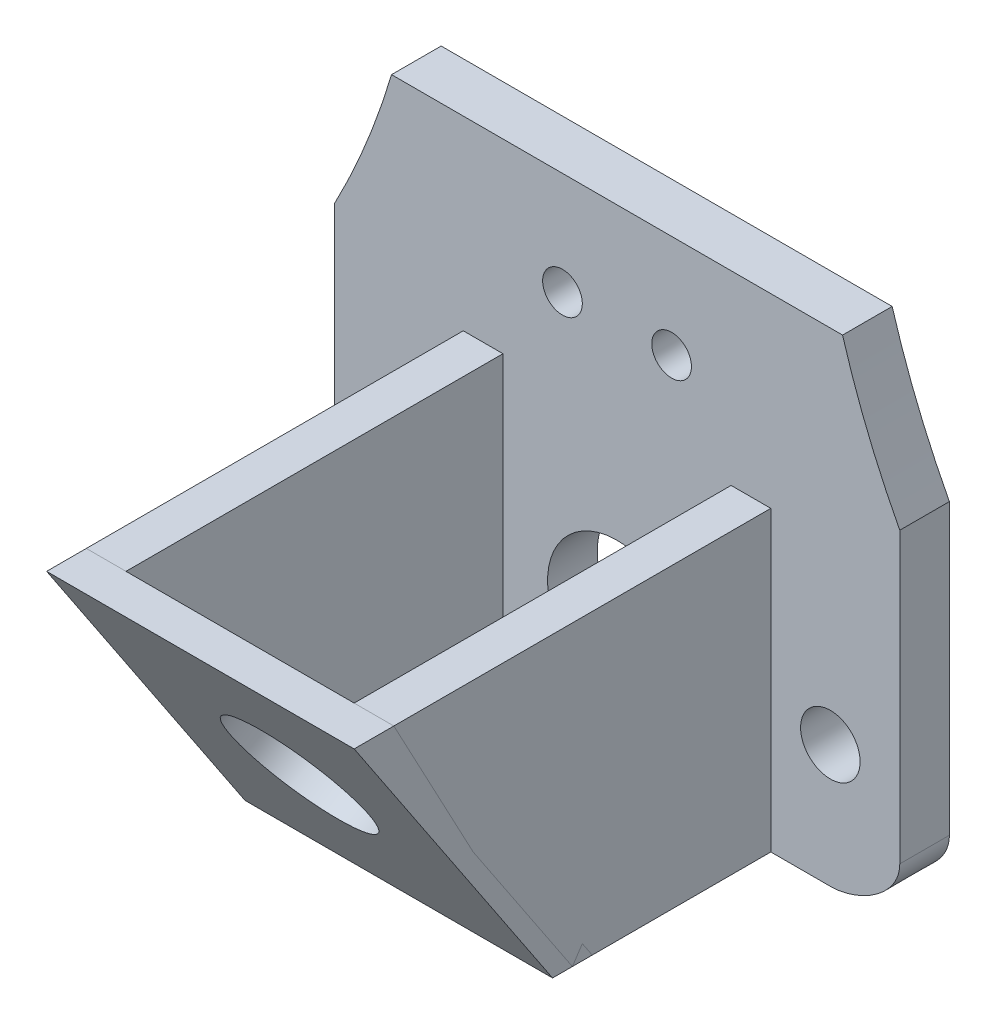
ISO-10303-21;
HEADER;
FILE_DESCRIPTION(('STEP AP214'),'2;1');
FILE_NAME('part.step','',(''),(''),'','','');
FILE_SCHEMA(('AUTOMOTIVE_DESIGN { 1 0 10303 214 1 1 1 1 }'));
ENDSEC;
DATA;
#1=APPLICATION_CONTEXT('core data for automotive mechanical design processes');
#2=APPLICATION_PROTOCOL_DEFINITION('international standard','automotive_design',2000,#1);
#3=PRODUCT_CONTEXT('',#1,'mechanical');
#4=PRODUCT('Part','Part','',(#3));
#5=PRODUCT_RELATED_PRODUCT_CATEGORY('part','',(#4));
#6=PRODUCT_DEFINITION_FORMATION('','',#4);
#7=PRODUCT_DEFINITION_CONTEXT('part definition',#1,'design');
#8=PRODUCT_DEFINITION('design','',#6,#7);
#9=PRODUCT_DEFINITION_SHAPE('','',#8);
#10=(LENGTH_UNIT() NAMED_UNIT(*) SI_UNIT(.MILLI.,.METRE.));
#11=(NAMED_UNIT(*) PLANE_ANGLE_UNIT() SI_UNIT($,.RADIAN.));
#12=(NAMED_UNIT(*) SI_UNIT($,.STERADIAN.) SOLID_ANGLE_UNIT());
#13=UNCERTAINTY_MEASURE_WITH_UNIT(LENGTH_MEASURE(1.E-05),#10,'distance_accuracy_value','');
#14=(GEOMETRIC_REPRESENTATION_CONTEXT(3) GLOBAL_UNCERTAINTY_ASSIGNED_CONTEXT((#13)) GLOBAL_UNIT_ASSIGNED_CONTEXT((#10,
#11,#12)) REPRESENTATION_CONTEXT('',''));
#15=CARTESIAN_POINT('',(0.,0.,0.));
#16=DIRECTION('',(0.,0.,1.));
#17=DIRECTION('',(1.,0.,0.));
#18=AXIS2_PLACEMENT_3D('',#15,#16,#17);
#19=CARTESIAN_POINT('',(17.4365114727916,15.948106541219,13.5));
#20=DIRECTION('',(1.,0.,0.));
#21=DIRECTION('',(0.,0.,-1.));
#22=AXIS2_PLACEMENT_3D('',#19,#20,#21);
#23=PLANE('',#22);
#24=DIRECTION('',(0.,0.,-1.));
#25=VECTOR('',#24,1.);
#26=CARTESIAN_POINT('',(17.4365114727916,30.948106541219,23.5));
#27=LINE('',#26,#25);
#28=CARTESIAN_POINT('',(17.4365114727916,30.948106541219,23.5));
#29=VERTEX_POINT('',#28);
#30=CARTESIAN_POINT('',(17.4365114727916,30.948106541219,21.5));
#31=VERTEX_POINT('',#30);
#32=EDGE_CURVE('E382',#29,#31,#27,.T.);
#33=ORIENTED_EDGE('',*,*,#32,.T.);
#34=DIRECTION('',(0.,-0.832050294337844,-0.554700196225229));
#35=VECTOR('',#34,1.);
#36=CARTESIAN_POINT('',(17.4365114727916,15.948106541219,11.5));
#37=LINE('',#36,#35);
#38=CARTESIAN_POINT('',(17.4365114727916,15.948106541219,11.5));
#39=VERTEX_POINT('',#38);
#40=EDGE_CURVE('E377',#31,#39,#37,.T.);
#41=ORIENTED_EDGE('',*,*,#40,.T.);
#42=DIRECTION('',(0.,0.,-1.));
#43=VECTOR('',#42,1.);
#44=CARTESIAN_POINT('',(17.4365114727916,15.948106541219,13.5));
#45=LINE('',#44,#43);
#46=CARTESIAN_POINT('',(17.4365114727916,15.948106541219,13.5));
#47=VERTEX_POINT('',#46);
#48=EDGE_CURVE('E14',#47,#39,#45,.T.);
#49=ORIENTED_EDGE('',*,*,#48,.F.);
#50=DIRECTION('',(0.,-0.832050294337844,-0.554700196225229));
#51=VECTOR('',#50,1.);
#52=CARTESIAN_POINT('',(17.4365114727916,15.948106541219,13.5));
#53=LINE('',#52,#51);
#54=EDGE_CURVE('E391',#29,#47,#53,.T.);
#55=ORIENTED_EDGE('',*,*,#54,.F.);
#56=EDGE_LOOP('',(#33,#41,#49,#55));
#57=FACE_BOUND('',#56,.T.);
#58=ADVANCED_FACE('F324',(#57),#23,.F.);
#59=CARTESIAN_POINT('',(32.9365114727916,15.948106541219,13.5));
#60=DIRECTION('',(0.,1.,0.));
#61=DIRECTION('',(-1.,0.,0.));
#62=AXIS2_PLACEMENT_3D('',#59,#60,#61);
#63=PLANE('',#62);
#64=ORIENTED_EDGE('',*,*,#48,.T.);
#65=DIRECTION('',(1.,0.,0.));
#66=VECTOR('',#65,1.);
#67=CARTESIAN_POINT('',(32.9365114727916,15.948106541219,11.5));
#68=LINE('',#67,#66);
#69=CARTESIAN_POINT('',(32.9365114727916,15.948106541219,11.5));
#70=VERTEX_POINT('',#69);
#71=EDGE_CURVE('E367',#39,#70,#68,.T.);
#72=ORIENTED_EDGE('',*,*,#71,.T.);
#73=DIRECTION('',(0.,0.,-1.));
#74=VECTOR('',#73,1.);
#75=CARTESIAN_POINT('',(32.9365114727916,15.948106541219,13.5));
#76=LINE('',#75,#74);
#77=CARTESIAN_POINT('',(32.9365114727916,15.948106541219,13.5));
#78=VERTEX_POINT('',#77);
#79=EDGE_CURVE('E332',#78,#70,#76,.T.);
#80=ORIENTED_EDGE('',*,*,#79,.F.);
#81=DIRECTION('',(1.,0.,0.));
#82=VECTOR('',#81,1.);
#83=CARTESIAN_POINT('',(32.9365114727916,15.948106541219,13.5));
#84=LINE('',#83,#82);
#85=EDGE_CURVE('E368',#47,#78,#84,.T.);
#86=ORIENTED_EDGE('',*,*,#85,.F.);
#87=EDGE_LOOP('',(#64,#72,#80,#86));
#88=FACE_BOUND('',#87,.T.);
#89=ADVANCED_FACE('F365',(#88),#63,.F.);
#90=CARTESIAN_POINT('',(32.9365114727916,30.948106541219,23.5));
#91=DIRECTION('',(-1.,0.,0.));
#92=DIRECTION('',(0.,0.,1.));
#93=AXIS2_PLACEMENT_3D('',#90,#91,#92);
#94=PLANE('',#93);
#95=ORIENTED_EDGE('',*,*,#79,.T.);
#96=DIRECTION('',(0.,0.832050294337844,0.554700196225229));
#97=VECTOR('',#96,1.);
#98=CARTESIAN_POINT('',(32.9365114727916,30.948106541219,21.5));
#99=LINE('',#98,#97);
#100=CARTESIAN_POINT('',(32.9365114727916,30.948106541219,21.5));
#101=VERTEX_POINT('',#100);
#102=EDGE_CURVE('E380',#70,#101,#99,.T.);
#103=ORIENTED_EDGE('',*,*,#102,.T.);
#104=DIRECTION('',(0.,0.,-1.));
#105=VECTOR('',#104,1.);
#106=CARTESIAN_POINT('',(32.9365114727916,30.948106541219,23.5));
#107=LINE('',#106,#105);
#108=CARTESIAN_POINT('',(32.9365114727916,30.948106541219,23.5));
#109=VERTEX_POINT('',#108);
#110=EDGE_CURVE('E397',#109,#101,#107,.T.);
#111=ORIENTED_EDGE('',*,*,#110,.F.);
#112=DIRECTION('',(0.,0.832050294337844,0.554700196225229));
#113=VECTOR('',#112,1.);
#114=CARTESIAN_POINT('',(32.9365114727916,30.948106541219,23.5));
#115=LINE('',#114,#113);
#116=EDGE_CURVE('E344',#78,#109,#115,.T.);
#117=ORIENTED_EDGE('',*,*,#116,.F.);
#118=EDGE_LOOP('',(#95,#103,#111,#117));
#119=FACE_BOUND('',#118,.T.);
#120=ADVANCED_FACE('F400',(#119),#94,.F.);
#121=CARTESIAN_POINT('',(17.4365114727916,30.948106541219,23.5));
#122=DIRECTION('',(0.,-1.,0.));
#123=DIRECTION('',(1.,0.,0.));
#124=AXIS2_PLACEMENT_3D('',#121,#122,#123);
#125=PLANE('',#124);
#126=ORIENTED_EDGE('',*,*,#110,.T.);
#127=DIRECTION('',(-1.,0.,0.));
#128=VECTOR('',#127,1.);
#129=CARTESIAN_POINT('',(17.4365114727916,30.948106541219,21.5));
#130=LINE('',#129,#128);
#131=EDGE_CURVE('E389',#101,#31,#130,.T.);
#132=ORIENTED_EDGE('',*,*,#131,.T.);
#133=ORIENTED_EDGE('',*,*,#32,.F.);
#134=DIRECTION('',(-1.,0.,0.));
#135=VECTOR('',#134,1.);
#136=CARTESIAN_POINT('',(17.4365114727916,30.948106541219,23.5));
#137=LINE('',#136,#135);
#138=EDGE_CURVE('E339',#109,#29,#137,.T.);
#139=ORIENTED_EDGE('',*,*,#138,.F.);
#140=EDGE_LOOP('',(#126,#132,#133,#139));
#141=FACE_BOUND('',#140,.T.);
#142=ADVANCED_FACE('F402',(#141),#125,.F.);
#143=CARTESIAN_POINT('',(0.,-0.86212106424031,2.29318159636046));
#144=DIRECTION('',(0.,0.554700196225229,-0.832050294337844));
#145=DIRECTION('',(0.,0.832050294337844,0.554700196225229));
#146=AXIS2_PLACEMENT_3D('',#143,#144,#145);
#147=PLANE('',#146);
#148=CARTESIAN_POINT('',(25.1865114727916,23.448106541219,18.5));
#149=DIRECTION('',(0.,-0.554700196225229,0.832050294337843));
#150=DIRECTION('',(0.,-0.832050294337843,-0.554700196225229));
#151=AXIS2_PLACEMENT_3D('',#148,#149,#150);
#152=CIRCLE('',#151,3.5);
#153=CARTESIAN_POINT('',(25.1865114727916,20.5359305110365,16.5585493132117));
#154=VERTEX_POINT('',#153);
#155=EDGE_CURVE('E385',#154,#154,#152,.T.);
#156=ORIENTED_EDGE('',*,*,#155,.F.);
#157=EDGE_LOOP('',(#156));
#158=FACE_BOUND('',#157,.T.);
#159=ORIENTED_EDGE('',*,*,#54,.T.);
#160=ORIENTED_EDGE('',*,*,#85,.T.);
#161=ORIENTED_EDGE('',*,*,#116,.T.);
#162=ORIENTED_EDGE('',*,*,#138,.T.);
#163=EDGE_LOOP('',(#159,#160,#161,#162));
#164=FACE_BOUND('',#163,.T.);
#165=ADVANCED_FACE('F403',(#158,#164),#147,.F.);
#166=CARTESIAN_POINT('',(0.,-0.86212106424031,0.293181596360463));
#167=DIRECTION('',(0.,0.554700196225229,-0.832050294337844));
#168=DIRECTION('',(0.,0.832050294337844,0.554700196225229));
#169=AXIS2_PLACEMENT_3D('',#166,#167,#168);
#170=PLANE('',#169);
#171=CARTESIAN_POINT('',(25.1865114727916,24.3711834642959,17.1153846153846));
#172=DIRECTION('',(0.,0.554700196225229,-0.832050294337844));
#173=DIRECTION('',(0.,0.832050294337844,0.554700196225229));
#174=AXIS2_PLACEMENT_3D('',#171,#172,#173);
#175=CIRCLE('',#174,3.5);
#176=CARTESIAN_POINT('',(25.1865114727916,27.2833594944784,19.0568353021729));
#177=VERTEX_POINT('',#176);
#178=EDGE_CURVE('E327',#177,#177,#175,.T.);
#179=ORIENTED_EDGE('',*,*,#178,.F.);
#180=EDGE_LOOP('',(#179));
#181=FACE_BOUND('',#180,.T.);
#182=ORIENTED_EDGE('',*,*,#40,.F.);
#183=ORIENTED_EDGE('',*,*,#131,.F.);
#184=ORIENTED_EDGE('',*,*,#102,.F.);
#185=ORIENTED_EDGE('',*,*,#71,.F.);
#186=EDGE_LOOP('',(#182,#183,#184,#185));
#187=FACE_BOUND('',#186,.T.);
#188=ADVANCED_FACE('F375',(#181,#187),#170,.T.);
#189=CARTESIAN_POINT('',(25.1865114727916,24.5575069336694,16.8358994113243));
#190=DIRECTION('',(0.,-0.554700196225229,0.832050294337843));
#191=DIRECTION('',(0.,-0.832050294337843,-0.554700196225229));
#192=AXIS2_PLACEMENT_3D('',#189,#190,#191);
#193=CYLINDRICAL_SURFACE('',#192,3.5);
#194=ORIENTED_EDGE('',*,*,#178,.T.);
#195=EDGE_LOOP('',(#194));
#196=FACE_BOUND('',#195,.T.);
#197=ORIENTED_EDGE('',*,*,#155,.T.);
#198=EDGE_LOOP('',(#197));
#199=FACE_BOUND('',#198,.T.);
#200=ADVANCED_FACE('F411',(#196,#199),#193,.F.);
#201=CLOSED_SHELL('',(#58,#89,#120,#142,#165,#188,#200));
#202=MANIFOLD_SOLID_BREP('B2',#201);
#203=CARTESIAN_POINT('',(38.4875310770758,83.0702422145585,2.5));
#204=DIRECTION('',(0.,0.,1.));
#205=DIRECTION('',(1.,0.,0.));
#206=AXIS2_PLACEMENT_3D('',#203,#204,#205);
#207=PLANE('',#206);
#208=DIRECTION('',(0.999999997232007,-7.44042106525713E-05,0.));
#209=VECTOR('',#208,1.);
#210=CARTESIAN_POINT('',(38.4843502252668,40.3192772856274,2.5));
#211=LINE('',#210,#209);
#212=CARTESIAN_POINT('',(13.8211849833558,40.3211123289745,2.5));
#213=VERTEX_POINT('',#212);
#214=CARTESIAN_POINT('',(36.5523405300605,40.3194210352842,2.5));
#215=VERTEX_POINT('',#214);
#216=EDGE_CURVE('E580',#213,#215,#211,.T.);
#217=ORIENTED_EDGE('',*,*,#216,.F.);
#218=CARTESIAN_POINT('',(-23.5634885272084,51.4290458230372,2.5));
#219=DIRECTION('',(0.,0.,1.));
#220=DIRECTION('',(1.,0.,0.));
#221=AXIS2_PLACEMENT_3D('',#218,#219,#220);
#222=CIRCLE('',#221,39.);
#223=CARTESIAN_POINT('',(10.9365114727916,33.242512343564,2.5));
#224=VERTEX_POINT('',#223);
#225=EDGE_CURVE('E587',#224,#213,#222,.T.);
#226=ORIENTED_EDGE('',*,*,#225,.F.);
#227=DIRECTION('',(0.,-1.,0.));
#228=VECTOR('',#227,1.);
#229=CARTESIAN_POINT('',(10.9365114727916,22.1790458230372,2.5));
#230=LINE('',#229,#228);
#231=CARTESIAN_POINT('',(10.9365114727916,18.6790458230372,2.5));
#232=VERTEX_POINT('',#231);
#233=EDGE_CURVE('E713',#224,#232,#230,.T.);
#234=ORIENTED_EDGE('',*,*,#233,.T.);
#235=CARTESIAN_POINT('',(10.9365114727916,18.6790458230372,2.5));
#236=CARTESIAN_POINT('',(10.9365114727916,17.1992549458831,2.5));
#237=CARTESIAN_POINT('',(12.9567205956374,15.948106541219,2.5));
#238=CARTESIAN_POINT('',(14.4365114727916,15.948106541219,2.5));
#239=B_SPLINE_CURVE_WITH_KNOTS('',3,(#235,#236,#237,#238),.UNSPECIFIED.,.F.,.F.,(4,4),(0.,
4.43937263146244),.UNSPECIFIED.);
#240=CARTESIAN_POINT('',(14.4365114727916,15.948106541219,2.5));
#241=VERTEX_POINT('',#240);
#242=EDGE_CURVE('E707',#232,#241,#239,.T.);
#243=ORIENTED_EDGE('',*,*,#242,.T.);
#244=DIRECTION('',(1.,0.,0.));
#245=VECTOR('',#244,1.);
#246=CARTESIAN_POINT('',(25.1865114727916,15.948106541219,2.5));
#247=LINE('',#246,#245);
#248=CARTESIAN_POINT('',(17.4365114727916,15.948106541219,2.5));
#249=VERTEX_POINT('',#248);
#250=EDGE_CURVE('E688',#241,#249,#247,.T.);
#251=ORIENTED_EDGE('',*,*,#250,.T.);
#252=DIRECTION('',(0.,-1.,0.));
#253=VECTOR('',#252,1.);
#254=CARTESIAN_POINT('',(17.4365114727916,15.948106541219,2.5));
#255=LINE('',#254,#253);
#256=CARTESIAN_POINT('',(17.4365114727916,30.948106541219,2.5));
#257=VERTEX_POINT('',#256);
#258=EDGE_CURVE('E628',#257,#249,#255,.T.);
#259=ORIENTED_EDGE('',*,*,#258,.F.);
#260=DIRECTION('',(-1.,0.,0.));
#261=VECTOR('',#260,1.);
#262=CARTESIAN_POINT('',(17.4365114727916,30.948106541219,2.5));
#263=LINE('',#262,#261);
#264=CARTESIAN_POINT('',(19.4365114727916,30.948106541219,2.5));
#265=VERTEX_POINT('',#264);
#266=EDGE_CURVE('E642',#265,#257,#263,.T.);
#267=ORIENTED_EDGE('',*,*,#266,.F.);
#268=DIRECTION('',(0.,1.,0.));
#269=VECTOR('',#268,1.);
#270=CARTESIAN_POINT('',(19.4365114727916,30.948106541219,2.5));
#271=LINE('',#270,#269);
#272=CARTESIAN_POINT('',(19.4365114727916,17.948106541219,2.5));
#273=VERTEX_POINT('',#272);
#274=EDGE_CURVE('E640',#273,#265,#271,.T.);
#275=ORIENTED_EDGE('',*,*,#274,.F.);
#276=DIRECTION('',(-1.,0.,0.));
#277=VECTOR('',#276,1.);
#278=CARTESIAN_POINT('',(30.9365114727916,17.948106541219,2.5));
#279=LINE('',#278,#277);
#280=CARTESIAN_POINT('',(30.9365114727916,17.948106541219,2.5));
#281=VERTEX_POINT('',#280);
#282=EDGE_CURVE('E637',#281,#273,#279,.T.);
#283=ORIENTED_EDGE('',*,*,#282,.F.);
#284=DIRECTION('',(0.,-1.,0.));
#285=VECTOR('',#284,1.);
#286=CARTESIAN_POINT('',(30.9365114727916,30.948106541219,2.5));
#287=LINE('',#286,#285);
#288=CARTESIAN_POINT('',(30.9365114727916,30.948106541219,2.5));
#289=VERTEX_POINT('',#288);
#290=EDGE_CURVE('E634',#289,#281,#287,.T.);
#291=ORIENTED_EDGE('',*,*,#290,.F.);
#292=DIRECTION('',(-1.,0.,0.));
#293=VECTOR('',#292,1.);
#294=CARTESIAN_POINT('',(32.9365114727916,30.948106541219,2.5));
#295=LINE('',#294,#293);
#296=CARTESIAN_POINT('',(32.9365114727916,30.948106541219,2.5));
#297=VERTEX_POINT('',#296);
#298=EDGE_CURVE('E632',#297,#289,#295,.T.);
#299=ORIENTED_EDGE('',*,*,#298,.F.);
#300=DIRECTION('',(0.,1.,0.));
#301=VECTOR('',#300,1.);
#302=CARTESIAN_POINT('',(32.9365114727916,15.948106541219,2.5));
#303=LINE('',#302,#301);
#304=CARTESIAN_POINT('',(32.9365114727916,15.948106541219,2.5));
#305=VERTEX_POINT('',#304);
#306=EDGE_CURVE('E624',#305,#297,#303,.T.);
#307=ORIENTED_EDGE('',*,*,#306,.F.);
#308=CARTESIAN_POINT('',(35.9365114727916,15.948106541219,2.5));
#309=VERTEX_POINT('',#308);
#310=EDGE_CURVE('E687',#305,#309,#247,.T.);
#311=ORIENTED_EDGE('',*,*,#310,.T.);
#312=CARTESIAN_POINT('',(39.4365114727916,18.6790458230372,2.5));
#313=CARTESIAN_POINT('',(39.4365114727916,17.1992549458831,2.5));
#314=CARTESIAN_POINT('',(37.4163023499458,15.948106541219,2.5));
#315=CARTESIAN_POINT('',(35.9365114727916,15.948106541219,2.5));
#316=B_SPLINE_CURVE_WITH_KNOTS('',3,(#312,#313,#314,#315),.UNSPECIFIED.,.F.,.F.,(4,4),(0.,
4.43937263146244),.UNSPECIFIED.);
#317=CARTESIAN_POINT('',(39.4365114727916,18.6790458230372,2.5));
#318=VERTEX_POINT('',#317);
#319=EDGE_CURVE('E680',#318,#309,#316,.T.);
#320=ORIENTED_EDGE('',*,*,#319,.F.);
#321=DIRECTION('',(0.,-1.,0.));
#322=VECTOR('',#321,1.);
#323=CARTESIAN_POINT('',(39.4365114727916,80.6790458230372,2.5));
#324=LINE('',#323,#322);
#325=CARTESIAN_POINT('',(39.4365114727916,33.242512343564,2.5));
#326=VERTEX_POINT('',#325);
#327=EDGE_CURVE('E678',#326,#318,#324,.T.);
#328=ORIENTED_EDGE('',*,*,#327,.F.);
#329=CARTESIAN_POINT('',(73.9365114727916,51.4290458230372,2.5));
#330=DIRECTION('',(0.,0.,1.));
#331=DIRECTION('',(1.,0.,0.));
#332=AXIS2_PLACEMENT_3D('',#329,#330,#331);
#333=CIRCLE('',#332,39.);
#334=EDGE_CURVE('E590',#215,#326,#333,.T.);
#335=ORIENTED_EDGE('',*,*,#334,.F.);
#336=EDGE_LOOP('',(#217,#226,#234,#243,#251,#259,#267,#275,#283,#291,#299,#307,#311,#320,#328,#335));
#337=FACE_BOUND('',#336,.T.);
#338=CARTESIAN_POINT('',(22.4365114727916,35.1326961955504,2.5));
#339=DIRECTION('',(0.,0.,1.));
#340=DIRECTION('',(1.,0.,0.));
#341=AXIS2_PLACEMENT_3D('',#338,#339,#340);
#342=CIRCLE('',#341,1.);
#343=CARTESIAN_POINT('',(23.4365114727916,35.1326961955504,2.5));
#344=VERTEX_POINT('',#343);
#345=EDGE_CURVE('E786',#344,#344,#342,.T.);
#346=ORIENTED_EDGE('',*,*,#345,.F.);
#347=EDGE_LOOP('',(#346));
#348=FACE_BOUND('',#347,.T.);
#349=CARTESIAN_POINT('',(27.9365114727916,35.1326961955504,2.5));
#350=DIRECTION('',(0.,0.,1.));
#351=DIRECTION('',(1.,0.,0.));
#352=AXIS2_PLACEMENT_3D('',#349,#350,#351);
#353=CIRCLE('',#352,1.);
#354=CARTESIAN_POINT('',(28.9365114727916,35.1326961955504,2.5));
#355=VERTEX_POINT('',#354);
#356=EDGE_CURVE('E591',#355,#355,#353,.T.);
#357=ORIENTED_EDGE('',*,*,#356,.F.);
#358=EDGE_LOOP('',(#357));
#359=FACE_BOUND('',#358,.T.);
#360=CARTESIAN_POINT('',(25.1865114727916,22.1790458230372,2.5));
#361=DIRECTION('',(0.,0.,1.));
#362=DIRECTION('',(1.,0.,0.));
#363=AXIS2_PLACEMENT_3D('',#360,#361,#362);
#364=CIRCLE('',#363,3.5);
#365=CARTESIAN_POINT('',(28.6865114727916,22.1790458230372,2.5));
#366=VERTEX_POINT('',#365);
#367=EDGE_CURVE('E603',#366,#366,#364,.T.);
#368=ORIENTED_EDGE('',*,*,#367,.F.);
#369=EDGE_LOOP('',(#368));
#370=FACE_BOUND('',#369,.T.);
#371=CARTESIAN_POINT('',(35.9365114727916,22.1326961955504,2.5));
#372=DIRECTION('',(0.,0.,1.));
#373=DIRECTION('',(1.,0.,0.));
#374=AXIS2_PLACEMENT_3D('',#371,#372,#373);
#375=CIRCLE('',#374,1.5);
#376=CARTESIAN_POINT('',(37.4365114727916,22.1326961955504,2.5));
#377=VERTEX_POINT('',#376);
#378=EDGE_CURVE('E672',#377,#377,#375,.T.);
#379=ORIENTED_EDGE('',*,*,#378,.F.);
#380=EDGE_LOOP('',(#379));
#381=FACE_BOUND('',#380,.T.);
#382=CARTESIAN_POINT('',(14.4365114727916,22.1326961955504,2.5));
#383=DIRECTION('',(0.,0.,1.));
#384=DIRECTION('',(1.,0.,0.));
#385=AXIS2_PLACEMENT_3D('',#382,#383,#384);
#386=CIRCLE('',#385,1.5);
#387=CARTESIAN_POINT('',(15.9365114727916,22.1326961955504,2.5));
#388=VERTEX_POINT('',#387);
#389=EDGE_CURVE('E666',#388,#388,#386,.T.);
#390=ORIENTED_EDGE('',*,*,#389,.F.);
#391=EDGE_LOOP('',(#390));
#392=FACE_BOUND('',#391,.T.);
#393=ADVANCED_FACE('F469',(#337,#348,#359,#370,#381,#392),#207,.T.);
#394=CARTESIAN_POINT('',(38.4875310770758,83.0702422145585,0.));
#395=DIRECTION('',(0.,0.,1.));
#396=DIRECTION('',(1.,0.,0.));
#397=AXIS2_PLACEMENT_3D('',#394,#395,#396);
#398=PLANE('',#397);
#399=CARTESIAN_POINT('',(-23.5634885272084,51.4290458230372,0.));
#400=DIRECTION('',(0.,0.,1.));
#401=DIRECTION('',(1.,0.,0.));
#402=AXIS2_PLACEMENT_3D('',#399,#400,#401);
#403=CIRCLE('',#402,39.);
#404=CARTESIAN_POINT('',(10.9365114727916,33.242512343564,0.));
#405=VERTEX_POINT('',#404);
#406=CARTESIAN_POINT('',(13.8211849833558,40.3211123289745,0.));
#407=VERTEX_POINT('',#406);
#408=EDGE_CURVE('E490',#405,#407,#403,.T.);
#409=ORIENTED_EDGE('',*,*,#408,.T.);
#410=DIRECTION('',(0.999999997232007,-7.44042106525713E-05,0.));
#411=VECTOR('',#410,1.);
#412=CARTESIAN_POINT('',(38.4843502252668,40.3192772856274,0.));
#413=LINE('',#412,#411);
#414=CARTESIAN_POINT('',(36.5523405300605,40.3194210352842,0.));
#415=VERTEX_POINT('',#414);
#416=EDGE_CURVE('E484',#407,#415,#413,.T.);
#417=ORIENTED_EDGE('',*,*,#416,.T.);
#418=CARTESIAN_POINT('',(73.9365114727916,51.4290458230372,0.));
#419=DIRECTION('',(0.,0.,1.));
#420=DIRECTION('',(1.,0.,0.));
#421=AXIS2_PLACEMENT_3D('',#418,#419,#420);
#422=CIRCLE('',#421,39.);
#423=CARTESIAN_POINT('',(39.4365114727916,33.242512343564,0.));
#424=VERTEX_POINT('',#423);
#425=EDGE_CURVE('E594',#415,#424,#422,.T.);
#426=ORIENTED_EDGE('',*,*,#425,.T.);
#427=DIRECTION('',(0.,-1.,0.));
#428=VECTOR('',#427,1.);
#429=CARTESIAN_POINT('',(39.4365114727916,22.1790458230372,0.));
#430=LINE('',#429,#428);
#431=CARTESIAN_POINT('',(39.4365114727916,18.6790458230372,0.));
#432=VERTEX_POINT('',#431);
#433=EDGE_CURVE('E675',#424,#432,#430,.T.);
#434=ORIENTED_EDGE('',*,*,#433,.T.);
#435=CARTESIAN_POINT('',(39.4365114727916,18.6790458230372,0.));
#436=CARTESIAN_POINT('',(39.4365114727916,17.1992549458831,0.));
#437=CARTESIAN_POINT('',(37.4163023499458,15.948106541219,0.));
#438=CARTESIAN_POINT('',(35.9365114727916,15.948106541219,0.));
#439=B_SPLINE_CURVE_WITH_KNOTS('',3,(#435,#436,#437,#438),.UNSPECIFIED.,.F.,.F.,(4,4),(0.,
4.43937263146244),.UNSPECIFIED.);
#440=CARTESIAN_POINT('',(35.9365114727916,15.948106541219,0.));
#441=VERTEX_POINT('',#440);
#442=EDGE_CURVE('E720',#432,#441,#439,.T.);
#443=ORIENTED_EDGE('',*,*,#442,.T.);
#444=DIRECTION('',(-1.,0.,0.));
#445=VECTOR('',#444,1.);
#446=CARTESIAN_POINT('',(25.1865114727916,15.948106541219,0.));
#447=LINE('',#446,#445);
#448=CARTESIAN_POINT('',(14.4365114727916,15.948106541219,0.));
#449=VERTEX_POINT('',#448);
#450=EDGE_CURVE('E725',#441,#449,#447,.T.);
#451=ORIENTED_EDGE('',*,*,#450,.T.);
#452=CARTESIAN_POINT('',(10.9365114727916,18.6790458230372,0.));
#453=CARTESIAN_POINT('',(10.9365114727916,17.1992549458831,0.));
#454=CARTESIAN_POINT('',(12.9567205956374,15.948106541219,0.));
#455=CARTESIAN_POINT('',(14.4365114727916,15.948106541219,0.));
#456=B_SPLINE_CURVE_WITH_KNOTS('',3,(#452,#453,#454,#455),.UNSPECIFIED.,.F.,.F.,(4,4),(0.,
4.43937263146244),.UNSPECIFIED.);
#457=CARTESIAN_POINT('',(10.9365114727916,18.6790458230372,0.));
#458=VERTEX_POINT('',#457);
#459=EDGE_CURVE('E731',#458,#449,#456,.T.);
#460=ORIENTED_EDGE('',*,*,#459,.F.);
#461=DIRECTION('',(0.,-1.,0.));
#462=VECTOR('',#461,1.);
#463=CARTESIAN_POINT('',(10.9365114727916,80.6790458230372,0.));
#464=LINE('',#463,#462);
#465=EDGE_CURVE('E681',#405,#458,#464,.T.);
#466=ORIENTED_EDGE('',*,*,#465,.F.);
#467=EDGE_LOOP('',(#409,#417,#426,#434,#443,#451,#460,#466));
#468=FACE_BOUND('',#467,.T.);
#469=CARTESIAN_POINT('',(22.4365114727916,35.1326961955504,0.));
#470=DIRECTION('',(0.,0.,1.));
#471=DIRECTION('',(1.,0.,0.));
#472=AXIS2_PLACEMENT_3D('',#469,#470,#471);
#473=CIRCLE('',#472,1.);
#474=CARTESIAN_POINT('',(23.4365114727916,35.1326961955504,0.));
#475=VERTEX_POINT('',#474);
#476=EDGE_CURVE('E597',#475,#475,#473,.T.);
#477=ORIENTED_EDGE('',*,*,#476,.T.);
#478=EDGE_LOOP('',(#477));
#479=FACE_BOUND('',#478,.T.);
#480=CARTESIAN_POINT('',(27.9365114727916,35.1326961955504,0.));
#481=DIRECTION('',(0.,0.,1.));
#482=DIRECTION('',(1.,0.,0.));
#483=AXIS2_PLACEMENT_3D('',#480,#481,#482);
#484=CIRCLE('',#483,1.);
#485=CARTESIAN_POINT('',(28.9365114727916,35.1326961955504,0.));
#486=VERTEX_POINT('',#485);
#487=EDGE_CURVE('E788',#486,#486,#484,.T.);
#488=ORIENTED_EDGE('',*,*,#487,.T.);
#489=EDGE_LOOP('',(#488));
#490=FACE_BOUND('',#489,.T.);
#491=CARTESIAN_POINT('',(25.1865114727916,22.1790458230372,0.));
#492=DIRECTION('',(0.,0.,1.));
#493=DIRECTION('',(1.,0.,0.));
#494=AXIS2_PLACEMENT_3D('',#491,#492,#493);
#495=CIRCLE('',#494,3.5);
#496=CARTESIAN_POINT('',(28.6865114727916,22.1790458230372,0.));
#497=VERTEX_POINT('',#496);
#498=EDGE_CURVE('E606',#497,#497,#495,.T.);
#499=ORIENTED_EDGE('',*,*,#498,.T.);
#500=EDGE_LOOP('',(#499));
#501=FACE_BOUND('',#500,.T.);
#502=CARTESIAN_POINT('',(35.9365114727916,22.1326961955504,0.));
#503=DIRECTION('',(0.,0.,1.));
#504=DIRECTION('',(1.,0.,0.));
#505=AXIS2_PLACEMENT_3D('',#502,#503,#504);
#506=CIRCLE('',#505,1.5);
#507=CARTESIAN_POINT('',(37.4365114727916,22.1326961955504,0.));
#508=VERTEX_POINT('',#507);
#509=EDGE_CURVE('E669',#508,#508,#506,.T.);
#510=ORIENTED_EDGE('',*,*,#509,.T.);
#511=EDGE_LOOP('',(#510));
#512=FACE_BOUND('',#511,.T.);
#513=CARTESIAN_POINT('',(14.4365114727916,22.1326961955504,0.));
#514=DIRECTION('',(0.,0.,1.));
#515=DIRECTION('',(1.,0.,0.));
#516=AXIS2_PLACEMENT_3D('',#513,#514,#515);
#517=CIRCLE('',#516,1.5);
#518=CARTESIAN_POINT('',(15.9365114727916,22.1326961955504,0.));
#519=VERTEX_POINT('',#518);
#520=EDGE_CURVE('E665',#519,#519,#517,.T.);
#521=ORIENTED_EDGE('',*,*,#520,.T.);
#522=EDGE_LOOP('',(#521));
#523=FACE_BOUND('',#522,.T.);
#524=ADVANCED_FACE('F759',(#468,#479,#490,#501,#512,#523),#398,.F.);
#525=CARTESIAN_POINT('',(10.9365114727916,80.6790458230372,2.5));
#526=DIRECTION('',(1.,0.,0.));
#527=DIRECTION('',(0.,1.,0.));
#528=AXIS2_PLACEMENT_3D('',#525,#526,#527);
#529=PLANE('',#528);
#530=ORIENTED_EDGE('',*,*,#233,.F.);
#531=DIRECTION('',(0.,0.,1.));
#532=VECTOR('',#531,1.);
#533=CARTESIAN_POINT('',(10.9365114727916,33.242512343564,-7.5));
#534=LINE('',#533,#532);
#535=EDGE_CURVE('E477',#224,#405,#534,.F.);
#536=ORIENTED_EDGE('',*,*,#535,.T.);
#537=ORIENTED_EDGE('',*,*,#465,.T.);
#538=DIRECTION('',(0.,0.,-1.));
#539=VECTOR('',#538,1.);
#540=CARTESIAN_POINT('',(10.9365114727916,18.6790458230372,2.5));
#541=LINE('',#540,#539);
#542=EDGE_CURVE('E740',#232,#458,#541,.T.);
#543=ORIENTED_EDGE('',*,*,#542,.F.);
#544=EDGE_LOOP('',(#530,#536,#537,#543));
#545=FACE_BOUND('',#544,.T.);
#546=ADVANCED_FACE('F704',(#545),#529,.F.);
#547=DIRECTION('',(0.,0.,-1.));
#548=VECTOR('',#547,1.);
#549=SURFACE_OF_LINEAR_EXTRUSION('',#239,#548);
#550=ORIENTED_EDGE('',*,*,#459,.T.);
#551=DIRECTION('',(0.,0.,-1.));
#552=VECTOR('',#551,1.);
#553=CARTESIAN_POINT('',(14.4365114727916,15.948106541219,2.5));
#554=LINE('',#553,#552);
#555=EDGE_CURVE('E744',#241,#449,#554,.T.);
#556=ORIENTED_EDGE('',*,*,#555,.F.);
#557=ORIENTED_EDGE('',*,*,#242,.F.);
#558=ORIENTED_EDGE('',*,*,#542,.T.);
#559=EDGE_LOOP('',(#550,#556,#557,#558));
#560=FACE_BOUND('',#559,.T.);
#561=ADVANCED_FACE('F700',(#560),#549,.F.);
#562=CARTESIAN_POINT('',(25.1865114727916,15.948106541219,2.5));
#563=DIRECTION('',(0.,-1.,0.));
#564=DIRECTION('',(1.,0.,0.));
#565=AXIS2_PLACEMENT_3D('',#562,#563,#564);
#566=PLANE('',#565);
#567=DIRECTION('',(-1.,0.,0.));
#568=VECTOR('',#567,1.);
#569=CARTESIAN_POINT('',(37.4365114727916,15.948106541219,12.5));
#570=LINE('',#569,#568);
#571=CARTESIAN_POINT('',(32.9365114727916,15.948106541219,12.5));
#572=VERTEX_POINT('',#571);
#573=CARTESIAN_POINT('',(17.4365114727916,15.948106541219,12.5));
#574=VERTEX_POINT('',#573);
#575=EDGE_CURVE('E609',#572,#574,#570,.T.);
#576=ORIENTED_EDGE('',*,*,#575,.T.);
#577=DIRECTION('',(0.,0.,-1.));
#578=VECTOR('',#577,1.);
#579=CARTESIAN_POINT('',(17.4365114727916,15.948106541219,22.5));
#580=LINE('',#579,#578);
#581=EDGE_CURVE('E630',#574,#249,#580,.T.);
#582=ORIENTED_EDGE('',*,*,#581,.T.);
#583=ORIENTED_EDGE('',*,*,#250,.F.);
#584=ORIENTED_EDGE('',*,*,#555,.T.);
#585=ORIENTED_EDGE('',*,*,#450,.F.);
#586=DIRECTION('',(0.,0.,-1.));
#587=VECTOR('',#586,1.);
#588=CARTESIAN_POINT('',(35.9365114727916,15.948106541219,2.5));
#589=LINE('',#588,#587);
#590=EDGE_CURVE('E746',#309,#441,#589,.T.);
#591=ORIENTED_EDGE('',*,*,#590,.F.);
#592=ORIENTED_EDGE('',*,*,#310,.F.);
#593=DIRECTION('',(0.,0.,-1.));
#594=VECTOR('',#593,1.);
#595=CARTESIAN_POINT('',(32.9365114727916,15.948106541219,22.5));
#596=LINE('',#595,#594);
#597=EDGE_CURVE('E663',#572,#305,#596,.T.);
#598=ORIENTED_EDGE('',*,*,#597,.F.);
#599=EDGE_LOOP('',(#576,#582,#583,#584,#585,#591,#592,#598));
#600=FACE_BOUND('',#599,.T.);
#601=ADVANCED_FACE('F696',(#600),#566,.T.);
#602=DIRECTION('',(0.,0.,-1.));
#603=VECTOR('',#602,1.);
#604=SURFACE_OF_LINEAR_EXTRUSION('',#316,#603);
#605=ORIENTED_EDGE('',*,*,#442,.F.);
#606=DIRECTION('',(0.,0.,-1.));
#607=VECTOR('',#606,1.);
#608=CARTESIAN_POINT('',(39.4365114727916,18.6790458230372,2.5));
#609=LINE('',#608,#607);
#610=EDGE_CURVE('E718',#318,#432,#609,.T.);
#611=ORIENTED_EDGE('',*,*,#610,.F.);
#612=ORIENTED_EDGE('',*,*,#319,.T.);
#613=ORIENTED_EDGE('',*,*,#590,.T.);
#614=EDGE_LOOP('',(#605,#611,#612,#613));
#615=FACE_BOUND('',#614,.T.);
#616=ADVANCED_FACE('F693',(#615),#604,.T.);
#617=CARTESIAN_POINT('',(39.4365114727916,22.1790458230372,2.5));
#618=DIRECTION('',(1.,0.,0.));
#619=DIRECTION('',(0.,0.,-1.));
#620=AXIS2_PLACEMENT_3D('',#617,#618,#619);
#621=PLANE('',#620);
#622=DIRECTION('',(0.,0.,1.));
#623=VECTOR('',#622,1.);
#624=CARTESIAN_POINT('',(39.4365114727916,33.242512343564,-7.5));
#625=LINE('',#624,#623);
#626=EDGE_CURVE('E743',#326,#424,#625,.F.);
#627=ORIENTED_EDGE('',*,*,#626,.F.);
#628=ORIENTED_EDGE('',*,*,#327,.T.);
#629=ORIENTED_EDGE('',*,*,#610,.T.);
#630=ORIENTED_EDGE('',*,*,#433,.F.);
#631=EDGE_LOOP('',(#627,#628,#629,#630));
#632=FACE_BOUND('',#631,.T.);
#633=ADVANCED_FACE('F471',(#632),#621,.T.);
#634=CARTESIAN_POINT('',(35.9365114727916,22.1326961955504,2.5));
#635=DIRECTION('',(0.,0.,-1.));
#636=DIRECTION('',(-1.,0.,0.));
#637=AXIS2_PLACEMENT_3D('',#634,#635,#636);
#638=CYLINDRICAL_SURFACE('',#637,1.5);
#639=ORIENTED_EDGE('',*,*,#378,.T.);
#640=EDGE_LOOP('',(#639));
#641=FACE_BOUND('',#640,.T.);
#642=ORIENTED_EDGE('',*,*,#509,.F.);
#643=EDGE_LOOP('',(#642));
#644=FACE_BOUND('',#643,.T.);
#645=ADVANCED_FACE('F810',(#641,#644),#638,.F.);
#646=CARTESIAN_POINT('',(14.4365114727916,22.1326961955504,2.5));
#647=DIRECTION('',(0.,0.,-1.));
#648=DIRECTION('',(-1.,0.,0.));
#649=AXIS2_PLACEMENT_3D('',#646,#647,#648);
#650=CYLINDRICAL_SURFACE('',#649,1.5);
#651=ORIENTED_EDGE('',*,*,#389,.T.);
#652=EDGE_LOOP('',(#651));
#653=FACE_BOUND('',#652,.T.);
#654=ORIENTED_EDGE('',*,*,#520,.F.);
#655=EDGE_LOOP('',(#654));
#656=FACE_BOUND('',#655,.T.);
#657=ADVANCED_FACE('F806',(#653,#656),#650,.F.);
#658=CARTESIAN_POINT('',(32.9365114727916,15.948106541219,22.5));
#659=DIRECTION('',(-1.,0.,0.));
#660=DIRECTION('',(0.,0.,1.));
#661=AXIS2_PLACEMENT_3D('',#658,#659,#660);
#662=PLANE('',#661);
#663=DIRECTION('',(0.,0.,-1.));
#664=VECTOR('',#663,1.);
#665=CARTESIAN_POINT('',(32.9365114727916,30.948106541219,22.5));
#666=LINE('',#665,#664);
#667=CARTESIAN_POINT('',(32.9365114727916,30.948106541219,22.5));
#668=VERTEX_POINT('',#667);
#669=EDGE_CURVE('E660',#668,#297,#666,.T.);
#670=ORIENTED_EDGE('',*,*,#669,.F.);
#671=DIRECTION('',(0.,-0.832050294337844,-0.554700196225229));
#672=VECTOR('',#671,1.);
#673=CARTESIAN_POINT('',(32.9365114727916,20.5634911566036,15.5769230769231));
#674=LINE('',#673,#672);
#675=EDGE_CURVE('E621',#668,#572,#674,.T.);
#676=ORIENTED_EDGE('',*,*,#675,.T.);
#677=ORIENTED_EDGE('',*,*,#597,.T.);
#678=ORIENTED_EDGE('',*,*,#306,.T.);
#679=EDGE_LOOP('',(#670,#676,#677,#678));
#680=FACE_BOUND('',#679,.T.);
#681=ADVANCED_FACE('F809',(#680),#662,.F.);
#682=CARTESIAN_POINT('',(32.9365114727916,30.948106541219,22.5));
#683=DIRECTION('',(0.,-1.,0.));
#684=DIRECTION('',(0.,0.,-1.));
#685=AXIS2_PLACEMENT_3D('',#682,#683,#684);
#686=PLANE('',#685);
#687=ORIENTED_EDGE('',*,*,#298,.T.);
#688=DIRECTION('',(0.,0.,-1.));
#689=VECTOR('',#688,1.);
#690=CARTESIAN_POINT('',(30.9365114727916,30.948106541219,22.5));
#691=LINE('',#690,#689);
#692=CARTESIAN_POINT('',(30.9365114727916,30.948106541219,22.5));
#693=VERTEX_POINT('',#692);
#694=EDGE_CURVE('E657',#693,#289,#691,.T.);
#695=ORIENTED_EDGE('',*,*,#694,.F.);
#696=DIRECTION('',(-1.,0.,0.));
#697=VECTOR('',#696,1.);
#698=CARTESIAN_POINT('',(32.9365114727916,30.948106541219,22.5));
#699=LINE('',#698,#697);
#700=EDGE_CURVE('E625',#668,#693,#699,.T.);
#701=ORIENTED_EDGE('',*,*,#700,.F.);
#702=ORIENTED_EDGE('',*,*,#669,.T.);
#703=EDGE_LOOP('',(#687,#695,#701,#702));
#704=FACE_BOUND('',#703,.T.);
#705=ADVANCED_FACE('F824',(#704),#686,.F.);
#706=CARTESIAN_POINT('',(30.9365114727916,30.948106541219,22.5));
#707=DIRECTION('',(1.,0.,0.));
#708=DIRECTION('',(0.,0.,-1.));
#709=AXIS2_PLACEMENT_3D('',#706,#707,#708);
#710=PLANE('',#709);
#711=DIRECTION('',(0.,0.,-1.));
#712=VECTOR('',#711,1.);
#713=CARTESIAN_POINT('',(30.9365114727916,17.948106541219,22.5));
#714=LINE('',#713,#712);
#715=CARTESIAN_POINT('',(30.9365114727916,17.948106541219,13.8333333333333));
#716=VERTEX_POINT('',#715);
#717=EDGE_CURVE('E655',#716,#281,#714,.T.);
#718=ORIENTED_EDGE('',*,*,#717,.F.);
#719=DIRECTION('',(0.,0.832050294337844,0.554700196225229));
#720=VECTOR('',#719,1.);
#721=CARTESIAN_POINT('',(30.9365114727916,30.948106541219,22.5));
#722=LINE('',#721,#720);
#723=EDGE_CURVE('E618',#716,#693,#722,.T.);
#724=ORIENTED_EDGE('',*,*,#723,.T.);
#725=ORIENTED_EDGE('',*,*,#694,.T.);
#726=ORIENTED_EDGE('',*,*,#290,.T.);
#727=EDGE_LOOP('',(#718,#724,#725,#726));
#728=FACE_BOUND('',#727,.T.);
#729=ADVANCED_FACE('F828',(#728),#710,.F.);
#730=CARTESIAN_POINT('',(30.9365114727916,17.948106541219,22.5));
#731=DIRECTION('',(0.,-1.,0.));
#732=DIRECTION('',(0.,0.,-1.));
#733=AXIS2_PLACEMENT_3D('',#730,#731,#732);
#734=PLANE('',#733);
#735=DIRECTION('',(0.,0.,-1.));
#736=VECTOR('',#735,1.);
#737=CARTESIAN_POINT('',(19.4365114727916,17.948106541219,22.5));
#738=LINE('',#737,#736);
#739=CARTESIAN_POINT('',(19.4365114727916,17.948106541219,13.8333333333333));
#740=VERTEX_POINT('',#739);
#741=EDGE_CURVE('E653',#740,#273,#738,.T.);
#742=ORIENTED_EDGE('',*,*,#741,.F.);
#743=DIRECTION('',(1.,0.,0.));
#744=VECTOR('',#743,1.);
#745=CARTESIAN_POINT('',(30.9365114727916,17.948106541219,13.8333333333333));
#746=LINE('',#745,#744);
#747=EDGE_CURVE('E615',#740,#716,#746,.T.);
#748=ORIENTED_EDGE('',*,*,#747,.T.);
#749=ORIENTED_EDGE('',*,*,#717,.T.);
#750=ORIENTED_EDGE('',*,*,#282,.T.);
#751=EDGE_LOOP('',(#742,#748,#749,#750));
#752=FACE_BOUND('',#751,.T.);
#753=ADVANCED_FACE('F832',(#752),#734,.F.);
#754=CARTESIAN_POINT('',(19.4365114727916,30.948106541219,22.5));
#755=DIRECTION('',(-1.,0.,0.));
#756=DIRECTION('',(0.,0.,1.));
#757=AXIS2_PLACEMENT_3D('',#754,#755,#756);
#758=PLANE('',#757);
#759=DIRECTION('',(0.,0.,-1.));
#760=VECTOR('',#759,1.);
#761=CARTESIAN_POINT('',(19.4365114727916,30.948106541219,22.5));
#762=LINE('',#761,#760);
#763=CARTESIAN_POINT('',(19.4365114727916,30.948106541219,22.5));
#764=VERTEX_POINT('',#763);
#765=EDGE_CURVE('E650',#764,#265,#762,.T.);
#766=ORIENTED_EDGE('',*,*,#765,.F.);
#767=DIRECTION('',(0.,-0.832050294337844,-0.554700196225229));
#768=VECTOR('',#767,1.);
#769=CARTESIAN_POINT('',(19.4365114727916,30.948106541219,22.5));
#770=LINE('',#769,#768);
#771=EDGE_CURVE('E612',#764,#740,#770,.T.);
#772=ORIENTED_EDGE('',*,*,#771,.T.);
#773=ORIENTED_EDGE('',*,*,#741,.T.);
#774=ORIENTED_EDGE('',*,*,#274,.T.);
#775=EDGE_LOOP('',(#766,#772,#773,#774));
#776=FACE_BOUND('',#775,.T.);
#777=ADVANCED_FACE('F836',(#776),#758,.F.);
#778=CARTESIAN_POINT('',(17.4365114727916,30.948106541219,22.5));
#779=DIRECTION('',(0.,-1.,0.));
#780=DIRECTION('',(0.,0.,-1.));
#781=AXIS2_PLACEMENT_3D('',#778,#779,#780);
#782=PLANE('',#781);
#783=ORIENTED_EDGE('',*,*,#266,.T.);
#784=DIRECTION('',(0.,0.,-1.));
#785=VECTOR('',#784,1.);
#786=CARTESIAN_POINT('',(17.4365114727916,30.948106541219,22.5));
#787=LINE('',#786,#785);
#788=CARTESIAN_POINT('',(17.4365114727916,30.948106541219,22.5));
#789=VERTEX_POINT('',#788);
#790=EDGE_CURVE('E648',#789,#257,#787,.T.);
#791=ORIENTED_EDGE('',*,*,#790,.F.);
#792=DIRECTION('',(-1.,0.,0.));
#793=VECTOR('',#792,1.);
#794=CARTESIAN_POINT('',(17.4365114727916,30.948106541219,22.5));
#795=LINE('',#794,#793);
#796=EDGE_CURVE('E627',#764,#789,#795,.T.);
#797=ORIENTED_EDGE('',*,*,#796,.F.);
#798=ORIENTED_EDGE('',*,*,#765,.T.);
#799=EDGE_LOOP('',(#783,#791,#797,#798));
#800=FACE_BOUND('',#799,.T.);
#801=ADVANCED_FACE('F840',(#800),#782,.F.);
#802=CARTESIAN_POINT('',(17.4365114727916,15.948106541219,22.5));
#803=DIRECTION('',(1.,0.,0.));
#804=DIRECTION('',(0.,0.,-1.));
#805=AXIS2_PLACEMENT_3D('',#802,#803,#804);
#806=PLANE('',#805);
#807=ORIENTED_EDGE('',*,*,#581,.F.);
#808=DIRECTION('',(0.,-0.832050294337844,-0.554700196225229));
#809=VECTOR('',#808,1.);
#810=CARTESIAN_POINT('',(17.4365114727916,15.948106541219,12.5));
#811=LINE('',#810,#809);
#812=EDGE_CURVE('E607',#789,#574,#811,.T.);
#813=ORIENTED_EDGE('',*,*,#812,.F.);
#814=ORIENTED_EDGE('',*,*,#790,.T.);
#815=ORIENTED_EDGE('',*,*,#258,.T.);
#816=EDGE_LOOP('',(#807,#813,#814,#815));
#817=FACE_BOUND('',#816,.T.);
#818=ADVANCED_FACE('F844',(#817),#806,.F.);
#819=CARTESIAN_POINT('',(37.4365114727916,15.948106541219,12.5));
#820=DIRECTION('',(0.,0.554700196225229,-0.832050294337844));
#821=DIRECTION('',(0.,0.832050294337844,0.554700196225229));
#822=AXIS2_PLACEMENT_3D('',#819,#820,#821);
#823=PLANE('',#822);
#824=ORIENTED_EDGE('',*,*,#700,.T.);
#825=ORIENTED_EDGE('',*,*,#723,.F.);
#826=ORIENTED_EDGE('',*,*,#747,.F.);
#827=ORIENTED_EDGE('',*,*,#771,.F.);
#828=ORIENTED_EDGE('',*,*,#796,.T.);
#829=ORIENTED_EDGE('',*,*,#812,.T.);
#830=ORIENTED_EDGE('',*,*,#575,.F.);
#831=ORIENTED_EDGE('',*,*,#675,.F.);
#832=EDGE_LOOP('',(#824,#825,#826,#827,#828,#829,#830,#831));
#833=FACE_BOUND('',#832,.T.);
#834=ADVANCED_FACE('F848',(#833),#823,.F.);
#835=CARTESIAN_POINT('',(25.1865114727916,22.1790458230372,-1.5));
#836=DIRECTION('',(0.,0.,1.));
#837=DIRECTION('',(1.,0.,0.));
#838=AXIS2_PLACEMENT_3D('',#835,#836,#837);
#839=CYLINDRICAL_SURFACE('',#838,3.5);
#840=ORIENTED_EDGE('',*,*,#367,.T.);
#841=EDGE_LOOP('',(#840));
#842=FACE_BOUND('',#841,.T.);
#843=ORIENTED_EDGE('',*,*,#498,.F.);
#844=EDGE_LOOP('',(#843));
#845=FACE_BOUND('',#844,.T.);
#846=ADVANCED_FACE('F852',(#842,#845),#839,.F.);
#847=CARTESIAN_POINT('',(73.9365114727916,51.4290458230372,-7.5));
#848=DIRECTION('',(0.,0.,1.));
#849=DIRECTION('',(1.,0.,0.));
#850=AXIS2_PLACEMENT_3D('',#847,#848,#849);
#851=CYLINDRICAL_SURFACE('',#850,39.);
#852=ORIENTED_EDGE('',*,*,#425,.F.);
#853=DIRECTION('',(0.,0.,1.));
#854=VECTOR('',#853,1.);
#855=CARTESIAN_POINT('',(36.5523405300605,40.3194210352842,-38.));
#856=LINE('',#855,#854);
#857=EDGE_CURVE('E780',#415,#215,#856,.T.);
#858=ORIENTED_EDGE('',*,*,#857,.T.);
#859=ORIENTED_EDGE('',*,*,#334,.T.);
#860=ORIENTED_EDGE('',*,*,#626,.T.);
#861=EDGE_LOOP('',(#852,#858,#859,#860));
#862=FACE_BOUND('',#861,.T.);
#863=ADVANCED_FACE('F779',(#862),#851,.F.);
#864=CARTESIAN_POINT('',(-23.5634885272084,51.4290458230372,-7.5));
#865=DIRECTION('',(0.,0.,1.));
#866=DIRECTION('',(1.,0.,0.));
#867=AXIS2_PLACEMENT_3D('',#864,#865,#866);
#868=CYLINDRICAL_SURFACE('',#867,39.);
#869=ORIENTED_EDGE('',*,*,#225,.T.);
#870=DIRECTION('',(0.,0.,1.));
#871=VECTOR('',#870,1.);
#872=CARTESIAN_POINT('',(13.8211849833558,40.3211123289745,-7.5));
#873=LINE('',#872,#871);
#874=EDGE_CURVE('E322',#213,#407,#873,.F.);
#875=ORIENTED_EDGE('',*,*,#874,.T.);
#876=ORIENTED_EDGE('',*,*,#408,.F.);
#877=ORIENTED_EDGE('',*,*,#535,.F.);
#878=EDGE_LOOP('',(#869,#875,#876,#877));
#879=FACE_BOUND('',#878,.T.);
#880=ADVANCED_FACE('F593',(#879),#868,.F.);
#881=CARTESIAN_POINT('',(27.9365114727916,35.1326961955504,0.));
#882=DIRECTION('',(0.,0.,1.));
#883=DIRECTION('',(1.,0.,0.));
#884=AXIS2_PLACEMENT_3D('',#881,#882,#883);
#885=CYLINDRICAL_SURFACE('',#884,1.);
#886=ORIENTED_EDGE('',*,*,#487,.F.);
#887=EDGE_LOOP('',(#886));
#888=FACE_BOUND('',#887,.T.);
#889=ORIENTED_EDGE('',*,*,#356,.T.);
#890=EDGE_LOOP('',(#889));
#891=FACE_BOUND('',#890,.T.);
#892=ADVANCED_FACE('F795',(#888,#891),#885,.F.);
#893=CARTESIAN_POINT('',(22.4365114727916,35.1326961955504,0.));
#894=DIRECTION('',(0.,0.,1.));
#895=DIRECTION('',(1.,0.,0.));
#896=AXIS2_PLACEMENT_3D('',#893,#894,#895);
#897=CYLINDRICAL_SURFACE('',#896,1.);
#898=ORIENTED_EDGE('',*,*,#476,.F.);
#899=EDGE_LOOP('',(#898));
#900=FACE_BOUND('',#899,.T.);
#901=ORIENTED_EDGE('',*,*,#345,.T.);
#902=EDGE_LOOP('',(#901));
#903=FACE_BOUND('',#902,.T.);
#904=ADVANCED_FACE('F863',(#900,#903),#897,.F.);
#905=CARTESIAN_POINT('',(13.8211849833558,40.3211123289745,-38.));
#906=DIRECTION('',(-7.44042106525713E-05,-0.999999997232007,0.));
#907=DIRECTION('',(0.999999997232007,-7.44042106525713E-05,0.));
#908=AXIS2_PLACEMENT_3D('',#905,#906,#907);
#909=PLANE('',#908);
#910=ORIENTED_EDGE('',*,*,#216,.T.);
#911=ORIENTED_EDGE('',*,*,#857,.F.);
#912=ORIENTED_EDGE('',*,*,#416,.F.);
#913=ORIENTED_EDGE('',*,*,#874,.F.);
#914=EDGE_LOOP('',(#910,#911,#912,#913));
#915=FACE_BOUND('',#914,.T.);
#916=ADVANCED_FACE('F579',(#915),#909,.F.);
#917=CLOSED_SHELL('',(#393,#524,#546,#561,#601,#616,#633,#645,#657,#681,#705,#729,#753,#777,
#801,#818,#834,#846,#863,#880,#892,#904,#916));
#918=MANIFOLD_SOLID_BREP('B8',#917);
#919=ADVANCED_BREP_SHAPE_REPRESENTATION('',(#18,#202,#918),#14);
#920=SHAPE_DEFINITION_REPRESENTATION(#9,#919);
ENDSEC;
END-ISO-10303-21;
